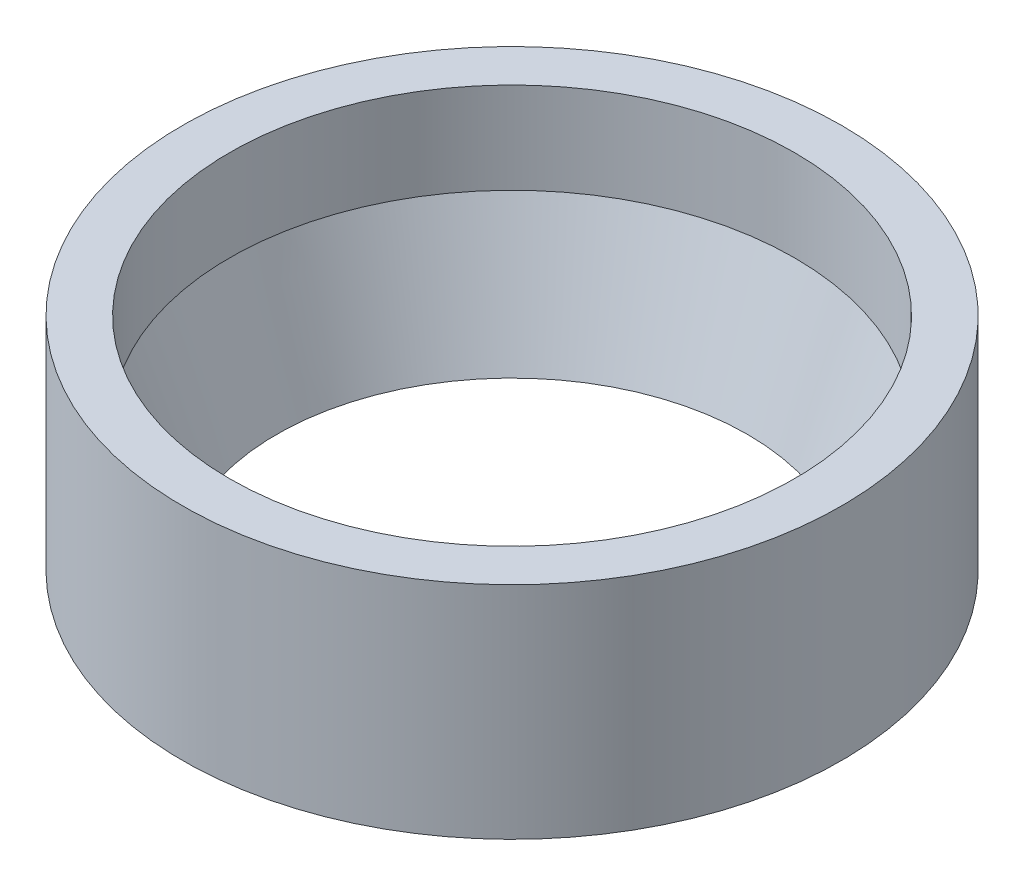
ISO-10303-21;
HEADER;
FILE_DESCRIPTION(('STEP AP214'),'2;1');
FILE_NAME('part.step','',(''),(''),'','','');
FILE_SCHEMA(('AUTOMOTIVE_DESIGN { 1 0 10303 214 1 1 1 1 }'));
ENDSEC;
DATA;
#1=APPLICATION_CONTEXT('core data for automotive mechanical design processes');
#2=APPLICATION_PROTOCOL_DEFINITION('international standard','automotive_design',2000,#1);
#3=PRODUCT_CONTEXT('',#1,'mechanical');
#4=PRODUCT('Part','Part','',(#3));
#5=PRODUCT_RELATED_PRODUCT_CATEGORY('part','',(#4));
#6=PRODUCT_DEFINITION_FORMATION('','',#4);
#7=PRODUCT_DEFINITION_CONTEXT('part definition',#1,'design');
#8=PRODUCT_DEFINITION('design','',#6,#7);
#9=PRODUCT_DEFINITION_SHAPE('','',#8);
#10=(LENGTH_UNIT() NAMED_UNIT(*) SI_UNIT(.MILLI.,.METRE.));
#11=(NAMED_UNIT(*) PLANE_ANGLE_UNIT() SI_UNIT($,.RADIAN.));
#12=(NAMED_UNIT(*) SI_UNIT($,.STERADIAN.) SOLID_ANGLE_UNIT());
#13=UNCERTAINTY_MEASURE_WITH_UNIT(LENGTH_MEASURE(1.E-05),#10,'distance_accuracy_value','');
#14=(GEOMETRIC_REPRESENTATION_CONTEXT(3) GLOBAL_UNCERTAINTY_ASSIGNED_CONTEXT((#13)) GLOBAL_UNIT_ASSIGNED_CONTEXT((#10,
#11,#12)) REPRESENTATION_CONTEXT('',''));
#15=CARTESIAN_POINT('',(0.,0.,0.));
#16=DIRECTION('',(0.,0.,1.));
#17=DIRECTION('',(1.,0.,0.));
#18=AXIS2_PLACEMENT_3D('',#15,#16,#17);
#19=CARTESIAN_POINT('',(0.,0.,0.));
#20=DIRECTION('',(0.,-1.,0.));
#21=DIRECTION('',(0.,0.,-1.));
#22=AXIS2_PLACEMENT_3D('',#19,#20,#21);
#23=PLANE('',#22);
#24=CARTESIAN_POINT('',(0.,0.,0.));
#25=DIRECTION('',(0.,-1.,0.));
#26=DIRECTION('',(0.,0.,-1.));
#27=AXIS2_PLACEMENT_3D('',#24,#25,#26);
#28=CIRCLE('',#27,44.45);
#29=CARTESIAN_POINT('',(0.,0.,-44.45));
#30=VERTEX_POINT('',#29);
#31=EDGE_CURVE('E10',#30,#30,#28,.T.);
#32=ORIENTED_EDGE('',*,*,#31,.F.);
#33=EDGE_LOOP('',(#32));
#34=FACE_BOUND('',#33,.T.);
#35=CARTESIAN_POINT('',(0.,0.,0.));
#36=DIRECTION('',(0.,-1.,0.));
#37=DIRECTION('',(0.,0.,-1.));
#38=AXIS2_PLACEMENT_3D('',#35,#36,#37);
#39=CIRCLE('',#38,38.1);
#40=CARTESIAN_POINT('',(0.,0.,-38.1));
#41=VERTEX_POINT('',#40);
#42=EDGE_CURVE('E64',#41,#41,#39,.T.);
#43=ORIENTED_EDGE('',*,*,#42,.T.);
#44=EDGE_LOOP('',(#43));
#45=FACE_BOUND('',#44,.T.);
#46=ADVANCED_FACE('F41',(#34,#45),#23,.F.);
#47=CARTESIAN_POINT('',(0.,0.,0.));
#48=DIRECTION('',(0.,-1.,0.));
#49=DIRECTION('',(0.,0.,-1.));
#50=AXIS2_PLACEMENT_3D('',#47,#48,#49);
#51=CYLINDRICAL_SURFACE('',#50,44.45);
#52=CARTESIAN_POINT('',(0.,-29.7434,0.));
#53=DIRECTION('',(0.,-1.,0.));
#54=DIRECTION('',(0.,0.,-1.));
#55=AXIS2_PLACEMENT_3D('',#52,#53,#54);
#56=CIRCLE('',#55,44.45);
#57=CARTESIAN_POINT('',(0.,-29.7434,-44.45));
#58=VERTEX_POINT('',#57);
#59=EDGE_CURVE('E48',#58,#58,#56,.T.);
#60=ORIENTED_EDGE('',*,*,#59,.F.);
#61=EDGE_LOOP('',(#60));
#62=FACE_BOUND('',#61,.T.);
#63=ORIENTED_EDGE('',*,*,#31,.T.);
#64=EDGE_LOOP('',(#63));
#65=FACE_BOUND('',#64,.T.);
#66=ADVANCED_FACE('F82',(#62,#65),#51,.T.);
#67=CARTESIAN_POINT('',(0.,-29.7434,0.));
#68=DIRECTION('',(0.,-1.,0.));
#69=DIRECTION('',(0.,0.,-1.));
#70=AXIS2_PLACEMENT_3D('',#67,#68,#69);
#71=PLANE('',#70);
#72=ORIENTED_EDGE('',*,*,#59,.T.);
#73=EDGE_LOOP('',(#72));
#74=FACE_BOUND('',#73,.T.);
#75=CARTESIAN_POINT('',(0.,-29.7434,0.));
#76=DIRECTION('',(0.,-1.,0.));
#77=DIRECTION('',(0.,0.,-1.));
#78=AXIS2_PLACEMENT_3D('',#75,#76,#77);
#79=CIRCLE('',#78,31.75);
#80=CARTESIAN_POINT('',(0.,-29.7434,-31.75));
#81=VERTEX_POINT('',#80);
#82=EDGE_CURVE('E53',#81,#81,#79,.T.);
#83=ORIENTED_EDGE('',*,*,#82,.F.);
#84=EDGE_LOOP('',(#83));
#85=FACE_BOUND('',#84,.T.);
#86=ADVANCED_FACE('F78',(#74,#85),#71,.T.);
#87=CARTESIAN_POINT('',(0.,-12.2969183864634,0.));
#88=DIRECTION('',(0.,1.,0.));
#89=DIRECTION('',(0.,0.,1.));
#90=AXIS2_PLACEMENT_3D('',#87,#88,#89);
#91=CONICAL_SURFACE('',#90,38.1,0.34906585039887);
#92=ORIENTED_EDGE('',*,*,#82,.T.);
#93=EDGE_LOOP('',(#92));
#94=FACE_BOUND('',#93,.T.);
#95=CARTESIAN_POINT('',(0.,-12.2969183864634,0.));
#96=DIRECTION('',(0.,-1.,0.));
#97=DIRECTION('',(0.,0.,-1.));
#98=AXIS2_PLACEMENT_3D('',#95,#96,#97);
#99=CIRCLE('',#98,38.1);
#100=CARTESIAN_POINT('',(0.,-12.2969183864634,-38.1));
#101=VERTEX_POINT('',#100);
#102=EDGE_CURVE('E58',#101,#101,#99,.T.);
#103=ORIENTED_EDGE('',*,*,#102,.F.);
#104=EDGE_LOOP('',(#103));
#105=FACE_BOUND('',#104,.T.);
#106=ADVANCED_FACE('F72',(#94,#105),#91,.F.);
#107=CARTESIAN_POINT('',(0.,0.,0.));
#108=DIRECTION('',(0.,-1.,0.));
#109=DIRECTION('',(0.,0.,-1.));
#110=AXIS2_PLACEMENT_3D('',#107,#108,#109);
#111=CYLINDRICAL_SURFACE('',#110,38.1);
#112=ORIENTED_EDGE('',*,*,#102,.T.);
#113=EDGE_LOOP('',(#112));
#114=FACE_BOUND('',#113,.T.);
#115=ORIENTED_EDGE('',*,*,#42,.F.);
#116=EDGE_LOOP('',(#115));
#117=FACE_BOUND('',#116,.T.);
#118=ADVANCED_FACE('F70',(#114,#117),#111,.F.);
#119=CLOSED_SHELL('',(#46,#66,#86,#106,#118));
#120=MANIFOLD_SOLID_BREP('B2',#119);
#121=ADVANCED_BREP_SHAPE_REPRESENTATION('',(#18,#120),#14);
#122=SHAPE_DEFINITION_REPRESENTATION(#9,#121);
ENDSEC;
END-ISO-10303-21;
